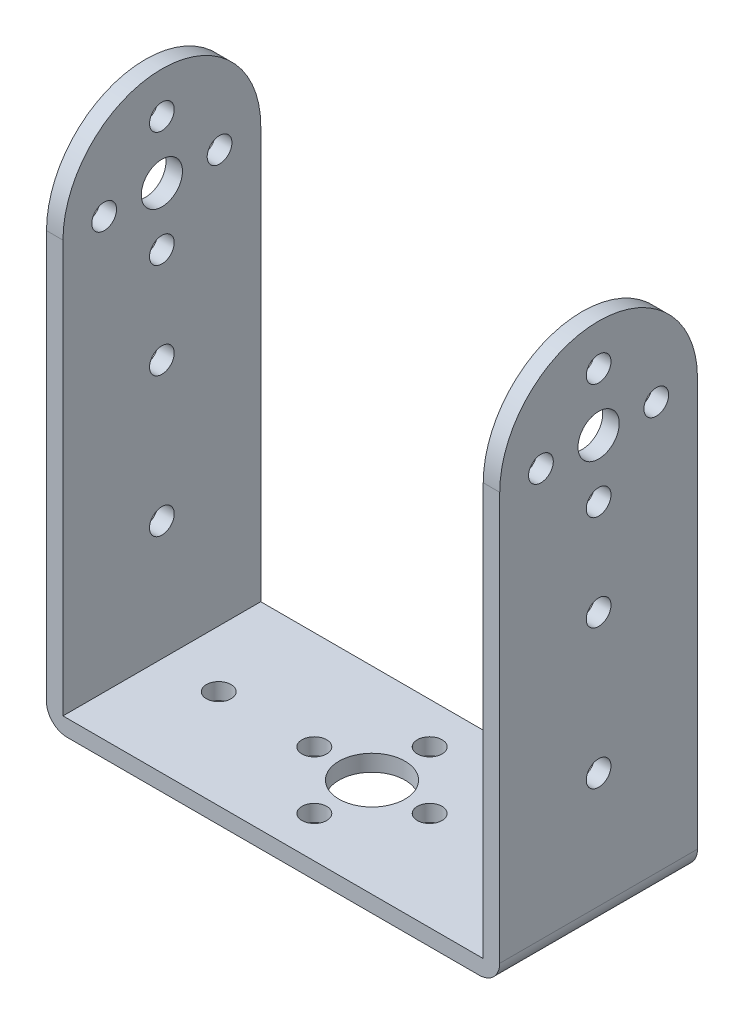
ISO-10303-21;
HEADER;
FILE_DESCRIPTION(('STEP AP214'),'2;1');
FILE_NAME('part.step','',(''),(''),'','','');
FILE_SCHEMA(('AUTOMOTIVE_DESIGN { 1 0 10303 214 1 1 1 1 }'));
ENDSEC;
DATA;
#1=APPLICATION_CONTEXT('core data for automotive mechanical design processes');
#2=APPLICATION_PROTOCOL_DEFINITION('international standard','automotive_design',2000,#1);
#3=PRODUCT_CONTEXT('',#1,'mechanical');
#4=PRODUCT('Part','Part','',(#3));
#5=PRODUCT_RELATED_PRODUCT_CATEGORY('part','',(#4));
#6=PRODUCT_DEFINITION_FORMATION('','',#4);
#7=PRODUCT_DEFINITION_CONTEXT('part definition',#1,'design');
#8=PRODUCT_DEFINITION('design','',#6,#7);
#9=PRODUCT_DEFINITION_SHAPE('','',#8);
#10=(LENGTH_UNIT() NAMED_UNIT(*) SI_UNIT(.MILLI.,.METRE.));
#11=(NAMED_UNIT(*) PLANE_ANGLE_UNIT() SI_UNIT($,.RADIAN.));
#12=(NAMED_UNIT(*) SI_UNIT($,.STERADIAN.) SOLID_ANGLE_UNIT());
#13=UNCERTAINTY_MEASURE_WITH_UNIT(LENGTH_MEASURE(1.E-05),#10,'distance_accuracy_value','');
#14=(GEOMETRIC_REPRESENTATION_CONTEXT(3) GLOBAL_UNCERTAINTY_ASSIGNED_CONTEXT((#13)) GLOBAL_UNIT_ASSIGNED_CONTEXT((#10,
#11,#12)) REPRESENTATION_CONTEXT('',''));
#15=CARTESIAN_POINT('',(0.,0.,0.));
#16=DIRECTION('',(0.,0.,1.));
#17=DIRECTION('',(1.,0.,0.));
#18=AXIS2_PLACEMENT_3D('',#15,#16,#17);
#19=CARTESIAN_POINT('',(0.,2.,0.));
#20=DIRECTION('',(0.,-1.,0.));
#21=DIRECTION('',(0.,0.,-1.));
#22=AXIS2_PLACEMENT_3D('',#19,#20,#21);
#23=PLANE('',#22);
#24=CARTESIAN_POINT('',(0.,2.,0.));
#25=DIRECTION('',(0.,1.,0.));
#26=DIRECTION('',(0.,0.,1.));
#27=AXIS2_PLACEMENT_3D('',#24,#25,#26);
#28=CIRCLE('',#27,4.);
#29=CARTESIAN_POINT('',(0.,2.,4.));
#30=VERTEX_POINT('',#29);
#31=EDGE_CURVE('E294',#30,#30,#28,.T.);
#32=ORIENTED_EDGE('',*,*,#31,.F.);
#33=EDGE_LOOP('',(#32));
#34=FACE_BOUND('',#33,.T.);
#35=CARTESIAN_POINT('',(0.,2.,-7.));
#36=DIRECTION('',(0.,1.,0.));
#37=DIRECTION('',(0.,0.,1.));
#38=AXIS2_PLACEMENT_3D('',#35,#36,#37);
#39=CIRCLE('',#38,1.5);
#40=CARTESIAN_POINT('',(0.,2.,-5.5));
#41=VERTEX_POINT('',#40);
#42=EDGE_CURVE('E286',#41,#41,#39,.T.);
#43=ORIENTED_EDGE('',*,*,#42,.F.);
#44=EDGE_LOOP('',(#43));
#45=FACE_BOUND('',#44,.T.);
#46=CARTESIAN_POINT('',(-18.6,2.,0.));
#47=DIRECTION('',(0.,1.,0.));
#48=DIRECTION('',(0.,0.,1.));
#49=AXIS2_PLACEMENT_3D('',#46,#47,#48);
#50=CIRCLE('',#49,1.5);
#51=CARTESIAN_POINT('',(-18.6,2.,1.5));
#52=VERTEX_POINT('',#51);
#53=EDGE_CURVE('E278',#52,#52,#50,.T.);
#54=ORIENTED_EDGE('',*,*,#53,.F.);
#55=EDGE_LOOP('',(#54));
#56=FACE_BOUND('',#55,.T.);
#57=CARTESIAN_POINT('',(7.00000000000079,2.,-7.94228966325903E-13));
#58=DIRECTION('',(0.,1.,0.));
#59=DIRECTION('',(0.,0.,1.));
#60=AXIS2_PLACEMENT_3D('',#57,#58,#59);
#61=CIRCLE('',#60,1.50000000000054);
#62=CARTESIAN_POINT('',(7.00000000000079,2.,1.49999999999975));
#63=VERTEX_POINT('',#62);
#64=EDGE_CURVE('E270',#63,#63,#61,.T.);
#65=ORIENTED_EDGE('',*,*,#64,.F.);
#66=EDGE_LOOP('',(#65));
#67=FACE_BOUND('',#66,.T.);
#68=CARTESIAN_POINT('',(1.58845793265181E-12,2.,7.));
#69=DIRECTION('',(0.,1.,0.));
#70=DIRECTION('',(0.,0.,1.));
#71=AXIS2_PLACEMENT_3D('',#68,#69,#70);
#72=CIRCLE('',#71,1.50000000000156);
#73=CARTESIAN_POINT('',(1.58845793265181E-12,2.,8.50000000000156));
#74=VERTEX_POINT('',#73);
#75=EDGE_CURVE('E262',#74,#74,#72,.T.);
#76=ORIENTED_EDGE('',*,*,#75,.F.);
#77=EDGE_LOOP('',(#76));
#78=FACE_BOUND('',#77,.T.);
#79=CARTESIAN_POINT('',(-6.99999999999921,2.,7.95086219085306E-13));
#80=DIRECTION('',(0.,1.,0.));
#81=DIRECTION('',(0.,0.,1.));
#82=AXIS2_PLACEMENT_3D('',#79,#80,#81);
#83=CIRCLE('',#82,1.50000000000106);
#84=CARTESIAN_POINT('',(-6.99999999999921,2.,1.50000000000185));
#85=VERTEX_POINT('',#84);
#86=EDGE_CURVE('E254',#85,#85,#83,.T.);
#87=ORIENTED_EDGE('',*,*,#86,.F.);
#88=EDGE_LOOP('',(#87));
#89=FACE_BOUND('',#88,.T.);
#90=CARTESIAN_POINT('',(18.6,2.,0.));
#91=DIRECTION('',(0.,1.,0.));
#92=DIRECTION('',(0.,0.,-1.));
#93=AXIS2_PLACEMENT_3D('',#90,#91,#92);
#94=CIRCLE('',#93,1.5);
#95=CARTESIAN_POINT('',(18.6,2.,-1.5));
#96=VERTEX_POINT('',#95);
#97=EDGE_CURVE('E246',#96,#96,#94,.T.);
#98=ORIENTED_EDGE('',*,*,#97,.F.);
#99=EDGE_LOOP('',(#98));
#100=FACE_BOUND('',#99,.T.);
#101=DIRECTION('',(0.,0.,1.));
#102=VECTOR('',#101,1.);
#103=CARTESIAN_POINT('',(25.5,2.,0.));
#104=LINE('',#103,#102);
#105=CARTESIAN_POINT('',(25.5,2.00000000000002,-12.));
#106=VERTEX_POINT('',#105);
#107=CARTESIAN_POINT('',(25.5,2.,12.));
#108=VERTEX_POINT('',#107);
#109=EDGE_CURVE('E159',#106,#108,#104,.T.);
#110=ORIENTED_EDGE('',*,*,#109,.F.);
#111=DIRECTION('',(-1.,0.,0.));
#112=VECTOR('',#111,1.);
#113=CARTESIAN_POINT('',(-27.5,2.,-12.));
#114=LINE('',#113,#112);
#115=CARTESIAN_POINT('',(-25.5,2.,-12.));
#116=VERTEX_POINT('',#115);
#117=EDGE_CURVE('E145',#106,#116,#114,.T.);
#118=ORIENTED_EDGE('',*,*,#117,.T.);
#119=DIRECTION('',(0.,0.,-1.));
#120=VECTOR('',#119,1.);
#121=CARTESIAN_POINT('',(-25.5,2.,0.));
#122=LINE('',#121,#120);
#123=CARTESIAN_POINT('',(-25.5,2.,12.));
#124=VERTEX_POINT('',#123);
#125=EDGE_CURVE('E238',#124,#116,#122,.T.);
#126=ORIENTED_EDGE('',*,*,#125,.F.);
#127=DIRECTION('',(1.,0.,0.));
#128=VECTOR('',#127,1.);
#129=CARTESIAN_POINT('',(-27.5,2.,12.));
#130=LINE('',#129,#128);
#131=EDGE_CURVE('E304',#124,#108,#130,.T.);
#132=ORIENTED_EDGE('',*,*,#131,.T.);
#133=EDGE_LOOP('',(#110,#118,#126,#132));
#134=FACE_BOUND('',#133,.T.);
#135=ADVANCED_FACE('F39',(#34,#45,#56,#67,#78,#89,#100,#134),#23,.F.);
#136=CARTESIAN_POINT('',(0.,0.,0.));
#137=DIRECTION('',(0.,-1.,0.));
#138=DIRECTION('',(0.,0.,-1.));
#139=AXIS2_PLACEMENT_3D('',#136,#137,#138);
#140=PLANE('',#139);
#141=DIRECTION('',(-1.,0.,0.));
#142=VECTOR('',#141,1.);
#143=CARTESIAN_POINT('',(-27.5,0.,-12.));
#144=LINE('',#143,#142);
#145=CARTESIAN_POINT('',(25.,0.,-12.));
#146=VERTEX_POINT('',#145);
#147=CARTESIAN_POINT('',(-25.,0.,-12.));
#148=VERTEX_POINT('',#147);
#149=EDGE_CURVE('E298',#146,#148,#144,.T.);
#150=ORIENTED_EDGE('',*,*,#149,.F.);
#151=DIRECTION('',(0.,0.,-1.));
#152=VECTOR('',#151,1.);
#153=CARTESIAN_POINT('',(25.,0.,12.));
#154=LINE('',#153,#152);
#155=CARTESIAN_POINT('',(25.,0.,12.));
#156=VERTEX_POINT('',#155);
#157=EDGE_CURVE('E62',#146,#156,#154,.F.);
#158=ORIENTED_EDGE('',*,*,#157,.T.);
#159=DIRECTION('',(1.,0.,0.));
#160=VECTOR('',#159,1.);
#161=CARTESIAN_POINT('',(-27.5,0.,12.));
#162=LINE('',#161,#160);
#163=CARTESIAN_POINT('',(-25.,0.,12.));
#164=VERTEX_POINT('',#163);
#165=EDGE_CURVE('E305',#164,#156,#162,.T.);
#166=ORIENTED_EDGE('',*,*,#165,.F.);
#167=DIRECTION('',(0.,0.,1.));
#168=VECTOR('',#167,1.);
#169=CARTESIAN_POINT('',(-25.,0.,-12.));
#170=LINE('',#169,#168);
#171=EDGE_CURVE('E338',#164,#148,#170,.F.);
#172=ORIENTED_EDGE('',*,*,#171,.T.);
#173=EDGE_LOOP('',(#150,#158,#166,#172));
#174=FACE_BOUND('',#173,.T.);
#175=CARTESIAN_POINT('',(-6.99999999999921,0.,7.95086219085306E-13));
#176=DIRECTION('',(0.,1.,0.));
#177=DIRECTION('',(0.,0.,1.));
#178=AXIS2_PLACEMENT_3D('',#175,#176,#177);
#179=CIRCLE('',#178,1.50000000000106);
#180=CARTESIAN_POINT('',(-6.99999999999921,0.,1.50000000000185));
#181=VERTEX_POINT('',#180);
#182=EDGE_CURVE('E250',#181,#181,#179,.T.);
#183=ORIENTED_EDGE('',*,*,#182,.T.);
#184=EDGE_LOOP('',(#183));
#185=FACE_BOUND('',#184,.T.);
#186=CARTESIAN_POINT('',(7.00000000000079,0.,-7.94228966325903E-13));
#187=DIRECTION('',(0.,1.,0.));
#188=DIRECTION('',(0.,0.,1.));
#189=AXIS2_PLACEMENT_3D('',#186,#187,#188);
#190=CIRCLE('',#189,1.50000000000054);
#191=CARTESIAN_POINT('',(7.00000000000079,0.,1.49999999999975));
#192=VERTEX_POINT('',#191);
#193=EDGE_CURVE('E266',#192,#192,#190,.T.);
#194=ORIENTED_EDGE('',*,*,#193,.T.);
#195=EDGE_LOOP('',(#194));
#196=FACE_BOUND('',#195,.T.);
#197=CARTESIAN_POINT('',(0.,0.,-7.));
#198=DIRECTION('',(0.,1.,0.));
#199=DIRECTION('',(0.,0.,1.));
#200=AXIS2_PLACEMENT_3D('',#197,#198,#199);
#201=CIRCLE('',#200,1.5);
#202=CARTESIAN_POINT('',(0.,0.,-5.5));
#203=VERTEX_POINT('',#202);
#204=EDGE_CURVE('E282',#203,#203,#201,.T.);
#205=ORIENTED_EDGE('',*,*,#204,.T.);
#206=EDGE_LOOP('',(#205));
#207=FACE_BOUND('',#206,.T.);
#208=CARTESIAN_POINT('',(0.,0.,0.));
#209=DIRECTION('',(0.,1.,0.));
#210=DIRECTION('',(0.,0.,1.));
#211=AXIS2_PLACEMENT_3D('',#208,#209,#210);
#212=CIRCLE('',#211,4.);
#213=CARTESIAN_POINT('',(0.,0.,4.));
#214=VERTEX_POINT('',#213);
#215=EDGE_CURVE('E290',#214,#214,#212,.T.);
#216=ORIENTED_EDGE('',*,*,#215,.T.);
#217=EDGE_LOOP('',(#216));
#218=FACE_BOUND('',#217,.T.);
#219=CARTESIAN_POINT('',(-18.6,0.,0.));
#220=DIRECTION('',(0.,1.,0.));
#221=DIRECTION('',(0.,0.,1.));
#222=AXIS2_PLACEMENT_3D('',#219,#220,#221);
#223=CIRCLE('',#222,1.5);
#224=CARTESIAN_POINT('',(-18.6,0.,1.5));
#225=VERTEX_POINT('',#224);
#226=EDGE_CURVE('E274',#225,#225,#223,.T.);
#227=ORIENTED_EDGE('',*,*,#226,.T.);
#228=EDGE_LOOP('',(#227));
#229=FACE_BOUND('',#228,.T.);
#230=CARTESIAN_POINT('',(1.58845793265181E-12,0.,7.));
#231=DIRECTION('',(0.,1.,0.));
#232=DIRECTION('',(0.,0.,1.));
#233=AXIS2_PLACEMENT_3D('',#230,#231,#232);
#234=CIRCLE('',#233,1.50000000000156);
#235=CARTESIAN_POINT('',(1.58845793265181E-12,0.,8.50000000000156));
#236=VERTEX_POINT('',#235);
#237=EDGE_CURVE('E258',#236,#236,#234,.T.);
#238=ORIENTED_EDGE('',*,*,#237,.T.);
#239=EDGE_LOOP('',(#238));
#240=FACE_BOUND('',#239,.T.);
#241=CARTESIAN_POINT('',(18.6,0.,0.));
#242=DIRECTION('',(0.,1.,0.));
#243=DIRECTION('',(0.,0.,-1.));
#244=AXIS2_PLACEMENT_3D('',#241,#242,#243);
#245=CIRCLE('',#244,1.5);
#246=CARTESIAN_POINT('',(18.6,0.,-1.5));
#247=VERTEX_POINT('',#246);
#248=EDGE_CURVE('E245',#247,#247,#245,.T.);
#249=ORIENTED_EDGE('',*,*,#248,.T.);
#250=EDGE_LOOP('',(#249));
#251=FACE_BOUND('',#250,.T.);
#252=ADVANCED_FACE('F355',(#174,#185,#196,#207,#218,#229,#240,#251),#140,.T.);
#253=CARTESIAN_POINT('',(27.5,2.,12.));
#254=DIRECTION('',(-1.,0.,0.));
#255=DIRECTION('',(0.,0.,1.));
#256=AXIS2_PLACEMENT_3D('',#253,#254,#255);
#257=PLANE('',#256);
#258=DIRECTION('',(0.,-1.,0.));
#259=VECTOR('',#258,1.);
#260=CARTESIAN_POINT('',(27.5,2.,12.));
#261=LINE('',#260,#259);
#262=CARTESIAN_POINT('',(27.5,52.,12.));
#263=VERTEX_POINT('',#262);
#264=CARTESIAN_POINT('',(27.5,2.5,12.));
#265=VERTEX_POINT('',#264);
#266=EDGE_CURVE('E308',#263,#265,#261,.T.);
#267=ORIENTED_EDGE('',*,*,#266,.T.);
#268=DIRECTION('',(0.,0.,-1.));
#269=VECTOR('',#268,1.);
#270=CARTESIAN_POINT('',(27.5,2.5,-12.));
#271=LINE('',#270,#269);
#272=CARTESIAN_POINT('',(27.5,2.5,-12.));
#273=VERTEX_POINT('',#272);
#274=EDGE_CURVE('E328',#265,#273,#271,.T.);
#275=ORIENTED_EDGE('',*,*,#274,.T.);
#276=DIRECTION('',(0.,-1.,0.));
#277=VECTOR('',#276,1.);
#278=CARTESIAN_POINT('',(27.5,2.,-12.));
#279=LINE('',#278,#277);
#280=CARTESIAN_POINT('',(27.5,52.,-12.));
#281=VERTEX_POINT('',#280);
#282=EDGE_CURVE('E325',#281,#273,#279,.T.);
#283=ORIENTED_EDGE('',*,*,#282,.F.);
#284=CARTESIAN_POINT('',(27.5,52.,0.));
#285=DIRECTION('',(-1.,0.,0.));
#286=DIRECTION('',(0.,0.,1.));
#287=AXIS2_PLACEMENT_3D('',#284,#285,#286);
#288=CIRCLE('',#287,12.);
#289=EDGE_CURVE('E137',#263,#281,#288,.T.);
#290=ORIENTED_EDGE('',*,*,#289,.F.);
#291=EDGE_LOOP('',(#267,#275,#283,#290));
#292=FACE_BOUND('',#291,.T.);
#293=CARTESIAN_POINT('',(27.5,33.4,0.));
#294=DIRECTION('',(-1.,0.,0.));
#295=DIRECTION('',(0.,0.,1.));
#296=AXIS2_PLACEMENT_3D('',#293,#294,#295);
#297=CIRCLE('',#296,1.5);
#298=CARTESIAN_POINT('',(27.5,33.4,1.5));
#299=VERTEX_POINT('',#298);
#300=EDGE_CURVE('E791',#299,#299,#297,.T.);
#301=ORIENTED_EDGE('',*,*,#300,.T.);
#302=EDGE_LOOP('',(#301));
#303=FACE_BOUND('',#302,.T.);
#304=CARTESIAN_POINT('',(27.5,45.,1.43162660300873E-13));
#305=DIRECTION('',(-1.,0.,0.));
#306=DIRECTION('',(0.,0.,1.));
#307=AXIS2_PLACEMENT_3D('',#304,#305,#306);
#308=CIRCLE('',#307,1.5);
#309=CARTESIAN_POINT('',(27.5,45.,1.50000000000014));
#310=VERTEX_POINT('',#309);
#311=EDGE_CURVE('E801',#310,#310,#308,.T.);
#312=ORIENTED_EDGE('',*,*,#311,.T.);
#313=EDGE_LOOP('',(#312));
#314=FACE_BOUND('',#313,.T.);
#315=CARTESIAN_POINT('',(27.5,59.,0.));
#316=DIRECTION('',(-1.,0.,0.));
#317=DIRECTION('',(0.,0.,1.));
#318=AXIS2_PLACEMENT_3D('',#315,#316,#317);
#319=CIRCLE('',#318,1.5);
#320=CARTESIAN_POINT('',(27.5,59.,1.5));
#321=VERTEX_POINT('',#320);
#322=EDGE_CURVE('E811',#321,#321,#319,.T.);
#323=ORIENTED_EDGE('',*,*,#322,.T.);
#324=EDGE_LOOP('',(#323));
#325=FACE_BOUND('',#324,.T.);
#326=CARTESIAN_POINT('',(27.5,16.5,0.));
#327=DIRECTION('',(-1.,0.,0.));
#328=DIRECTION('',(0.,0.,1.));
#329=AXIS2_PLACEMENT_3D('',#326,#327,#328);
#330=CIRCLE('',#329,1.5);
#331=CARTESIAN_POINT('',(27.5,16.5,1.5));
#332=VERTEX_POINT('',#331);
#333=EDGE_CURVE('E153',#332,#332,#330,.T.);
#334=ORIENTED_EDGE('',*,*,#333,.T.);
#335=EDGE_LOOP('',(#334));
#336=FACE_BOUND('',#335,.T.);
#337=CARTESIAN_POINT('',(27.5,52.,0.));
#338=DIRECTION('',(-1.,0.,0.));
#339=DIRECTION('',(0.,0.,1.));
#340=AXIS2_PLACEMENT_3D('',#337,#338,#339);
#341=CIRCLE('',#340,2.5);
#342=CARTESIAN_POINT('',(27.5,52.,2.5));
#343=VERTEX_POINT('',#342);
#344=EDGE_CURVE('E817',#343,#343,#341,.T.);
#345=ORIENTED_EDGE('',*,*,#344,.T.);
#346=EDGE_LOOP('',(#345));
#347=FACE_BOUND('',#346,.T.);
#348=CARTESIAN_POINT('',(27.5,52.0000000000001,7.0000000000001));
#349=DIRECTION('',(-1.,0.,0.));
#350=DIRECTION('',(0.,0.,1.));
#351=AXIS2_PLACEMENT_3D('',#348,#349,#350);
#352=CIRCLE('',#351,1.5);
#353=CARTESIAN_POINT('',(27.5,52.0000000000001,8.5000000000001));
#354=VERTEX_POINT('',#353);
#355=EDGE_CURVE('E805',#354,#354,#352,.T.);
#356=ORIENTED_EDGE('',*,*,#355,.T.);
#357=EDGE_LOOP('',(#356));
#358=FACE_BOUND('',#357,.T.);
#359=CARTESIAN_POINT('',(27.5,52.,-6.9999999999999));
#360=DIRECTION('',(-1.,0.,0.));
#361=DIRECTION('',(0.,0.,1.));
#362=AXIS2_PLACEMENT_3D('',#359,#360,#361);
#363=CIRCLE('',#362,1.50000000000001);
#364=CARTESIAN_POINT('',(27.5,52.,-5.4999999999999));
#365=VERTEX_POINT('',#364);
#366=EDGE_CURVE('E790',#365,#365,#363,.T.);
#367=ORIENTED_EDGE('',*,*,#366,.T.);
#368=EDGE_LOOP('',(#367));
#369=FACE_BOUND('',#368,.T.);
#370=ADVANCED_FACE('F351',(#292,#303,#314,#325,#336,#347,#358,#369),#257,.F.);
#371=CARTESIAN_POINT('',(-27.5,2.,-12.));
#372=DIRECTION('',(0.,0.,1.));
#373=DIRECTION('',(1.,0.,0.));
#374=AXIS2_PLACEMENT_3D('',#371,#372,#373);
#375=PLANE('',#374);
#376=ORIENTED_EDGE('',*,*,#282,.T.);
#377=CARTESIAN_POINT('',(25.,2.5,-12.));
#378=DIRECTION('',(0.,0.,1.));
#379=DIRECTION('',(1.,0.,0.));
#380=AXIS2_PLACEMENT_3D('',#377,#378,#379);
#381=CIRCLE('',#380,2.5);
#382=EDGE_CURVE('E335',#273,#146,#381,.F.);
#383=ORIENTED_EDGE('',*,*,#382,.T.);
#384=ORIENTED_EDGE('',*,*,#149,.T.);
#385=CARTESIAN_POINT('',(-25.,2.5,-12.));
#386=DIRECTION('',(0.,0.,1.));
#387=DIRECTION('',(1.,0.,0.));
#388=AXIS2_PLACEMENT_3D('',#385,#386,#387);
#389=CIRCLE('',#388,2.5);
#390=CARTESIAN_POINT('',(-27.5,2.5,-12.));
#391=VERTEX_POINT('',#390);
#392=EDGE_CURVE('E332',#148,#391,#389,.F.);
#393=ORIENTED_EDGE('',*,*,#392,.T.);
#394=DIRECTION('',(0.,-1.,0.));
#395=VECTOR('',#394,1.);
#396=CARTESIAN_POINT('',(-27.5,2.,-12.));
#397=LINE('',#396,#395);
#398=CARTESIAN_POINT('',(-27.5,52.,-12.));
#399=VERTEX_POINT('',#398);
#400=EDGE_CURVE('E321',#399,#391,#397,.T.);
#401=ORIENTED_EDGE('',*,*,#400,.F.);
#402=DIRECTION('',(-1.,0.,0.));
#403=VECTOR('',#402,1.);
#404=CARTESIAN_POINT('',(-25.5,52.,-12.));
#405=LINE('',#404,#403);
#406=CARTESIAN_POINT('',(-25.5,52.,-12.));
#407=VERTEX_POINT('',#406);
#408=EDGE_CURVE('E234',#407,#399,#405,.T.);
#409=ORIENTED_EDGE('',*,*,#408,.F.);
#410=DIRECTION('',(0.,-1.,0.));
#411=VECTOR('',#410,1.);
#412=CARTESIAN_POINT('',(-25.5,52.,-12.));
#413=LINE('',#412,#411);
#414=EDGE_CURVE('E227',#407,#116,#413,.T.);
#415=ORIENTED_EDGE('',*,*,#414,.T.);
#416=ORIENTED_EDGE('',*,*,#117,.F.);
#417=DIRECTION('',(0.,-1.,0.));
#418=VECTOR('',#417,1.);
#419=CARTESIAN_POINT('',(25.5,52.,-12.));
#420=LINE('',#419,#418);
#421=CARTESIAN_POINT('',(25.5,52.,-12.));
#422=VERTEX_POINT('',#421);
#423=EDGE_CURVE('E124',#422,#106,#420,.T.);
#424=ORIENTED_EDGE('',*,*,#423,.F.);
#425=DIRECTION('',(1.,0.,0.));
#426=VECTOR('',#425,1.);
#427=CARTESIAN_POINT('',(25.5,52.,-12.));
#428=LINE('',#427,#426);
#429=EDGE_CURVE('E134',#422,#281,#428,.T.);
#430=ORIENTED_EDGE('',*,*,#429,.T.);
#431=EDGE_LOOP('',(#376,#383,#384,#393,#401,#409,#415,#416,#424,#430));
#432=FACE_BOUND('',#431,.T.);
#433=ADVANCED_FACE('F143',(#432),#375,.F.);
#434=CARTESIAN_POINT('',(-27.5,2.,12.));
#435=DIRECTION('',(1.,0.,0.));
#436=DIRECTION('',(0.,0.,-1.));
#437=AXIS2_PLACEMENT_3D('',#434,#435,#436);
#438=PLANE('',#437);
#439=ORIENTED_EDGE('',*,*,#400,.T.);
#440=DIRECTION('',(0.,0.,1.));
#441=VECTOR('',#440,1.);
#442=CARTESIAN_POINT('',(-27.5,2.5,12.));
#443=LINE('',#442,#441);
#444=CARTESIAN_POINT('',(-27.5,2.5,12.));
#445=VERTEX_POINT('',#444);
#446=EDGE_CURVE('E11',#391,#445,#443,.T.);
#447=ORIENTED_EDGE('',*,*,#446,.T.);
#448=DIRECTION('',(0.,-1.,0.));
#449=VECTOR('',#448,1.);
#450=CARTESIAN_POINT('',(-27.5,2.,12.));
#451=LINE('',#450,#449);
#452=CARTESIAN_POINT('',(-27.5,52.,12.));
#453=VERTEX_POINT('',#452);
#454=EDGE_CURVE('E317',#453,#445,#451,.T.);
#455=ORIENTED_EDGE('',*,*,#454,.F.);
#456=CARTESIAN_POINT('',(-27.5,52.,0.));
#457=DIRECTION('',(-1.,0.,0.));
#458=DIRECTION('',(0.,0.,1.));
#459=AXIS2_PLACEMENT_3D('',#456,#457,#458);
#460=CIRCLE('',#459,12.);
#461=EDGE_CURVE('E216',#453,#399,#460,.T.);
#462=ORIENTED_EDGE('',*,*,#461,.T.);
#463=EDGE_LOOP('',(#439,#447,#455,#462));
#464=FACE_BOUND('',#463,.T.);
#465=CARTESIAN_POINT('',(-27.5,16.5,0.));
#466=DIRECTION('',(-1.,0.,0.));
#467=DIRECTION('',(0.,0.,1.));
#468=AXIS2_PLACEMENT_3D('',#465,#466,#467);
#469=CIRCLE('',#468,1.5);
#470=CARTESIAN_POINT('',(-27.5,16.5,1.5));
#471=VERTEX_POINT('',#470);
#472=EDGE_CURVE('E208',#471,#471,#469,.T.);
#473=ORIENTED_EDGE('',*,*,#472,.F.);
#474=EDGE_LOOP('',(#473));
#475=FACE_BOUND('',#474,.T.);
#476=CARTESIAN_POINT('',(-27.5,52.,0.));
#477=DIRECTION('',(-1.,0.,0.));
#478=DIRECTION('',(0.,0.,1.));
#479=AXIS2_PLACEMENT_3D('',#476,#477,#478);
#480=CIRCLE('',#479,2.5);
#481=CARTESIAN_POINT('',(-27.5,52.,2.5));
#482=VERTEX_POINT('',#481);
#483=EDGE_CURVE('E200',#482,#482,#480,.T.);
#484=ORIENTED_EDGE('',*,*,#483,.F.);
#485=EDGE_LOOP('',(#484));
#486=FACE_BOUND('',#485,.T.);
#487=CARTESIAN_POINT('',(-27.5,59.,0.));
#488=DIRECTION('',(-1.,0.,0.));
#489=DIRECTION('',(0.,0.,1.));
#490=AXIS2_PLACEMENT_3D('',#487,#488,#489);
#491=CIRCLE('',#490,1.5);
#492=CARTESIAN_POINT('',(-27.5,59.,1.5));
#493=VERTEX_POINT('',#492);
#494=EDGE_CURVE('E192',#493,#493,#491,.T.);
#495=ORIENTED_EDGE('',*,*,#494,.F.);
#496=EDGE_LOOP('',(#495));
#497=FACE_BOUND('',#496,.T.);
#498=CARTESIAN_POINT('',(-27.5,52.0000000000001,7.0000000000001));
#499=DIRECTION('',(-1.,0.,0.));
#500=DIRECTION('',(0.,0.,1.));
#501=AXIS2_PLACEMENT_3D('',#498,#499,#500);
#502=CIRCLE('',#501,1.5);
#503=CARTESIAN_POINT('',(-27.5,52.0000000000001,8.5000000000001));
#504=VERTEX_POINT('',#503);
#505=EDGE_CURVE('E184',#504,#504,#502,.T.);
#506=ORIENTED_EDGE('',*,*,#505,.F.);
#507=EDGE_LOOP('',(#506));
#508=FACE_BOUND('',#507,.T.);
#509=CARTESIAN_POINT('',(-27.5,45.,1.43162660300873E-13));
#510=DIRECTION('',(-1.,0.,0.));
#511=DIRECTION('',(0.,0.,1.));
#512=AXIS2_PLACEMENT_3D('',#509,#510,#511);
#513=CIRCLE('',#512,1.5);
#514=CARTESIAN_POINT('',(-27.5,45.,1.50000000000014));
#515=VERTEX_POINT('',#514);
#516=EDGE_CURVE('E176',#515,#515,#513,.T.);
#517=ORIENTED_EDGE('',*,*,#516,.F.);
#518=EDGE_LOOP('',(#517));
#519=FACE_BOUND('',#518,.T.);
#520=CARTESIAN_POINT('',(-27.5,52.,-6.9999999999999));
#521=DIRECTION('',(-1.,0.,0.));
#522=DIRECTION('',(0.,0.,1.));
#523=AXIS2_PLACEMENT_3D('',#520,#521,#522);
#524=CIRCLE('',#523,1.50000000000001);
#525=CARTESIAN_POINT('',(-27.5,52.,-5.4999999999999));
#526=VERTEX_POINT('',#525);
#527=EDGE_CURVE('E168',#526,#526,#524,.T.);
#528=ORIENTED_EDGE('',*,*,#527,.F.);
#529=EDGE_LOOP('',(#528));
#530=FACE_BOUND('',#529,.T.);
#531=CARTESIAN_POINT('',(-27.5,33.4,0.));
#532=DIRECTION('',(-1.,0.,0.));
#533=DIRECTION('',(0.,0.,1.));
#534=AXIS2_PLACEMENT_3D('',#531,#532,#533);
#535=CIRCLE('',#534,1.5);
#536=CARTESIAN_POINT('',(-27.5,33.4,1.5));
#537=VERTEX_POINT('',#536);
#538=EDGE_CURVE('E163',#537,#537,#535,.T.);
#539=ORIENTED_EDGE('',*,*,#538,.F.);
#540=EDGE_LOOP('',(#539));
#541=FACE_BOUND('',#540,.T.);
#542=ADVANCED_FACE('F358',(#464,#475,#486,#497,#508,#519,#530,#541),#438,.F.);
#543=CARTESIAN_POINT('',(-27.5,2.,12.));
#544=DIRECTION('',(0.,0.,-1.));
#545=DIRECTION('',(-1.,0.,0.));
#546=AXIS2_PLACEMENT_3D('',#543,#544,#545);
#547=PLANE('',#546);
#548=ORIENTED_EDGE('',*,*,#165,.T.);
#549=CARTESIAN_POINT('',(25.,2.5,12.));
#550=DIRECTION('',(0.,0.,-1.));
#551=DIRECTION('',(-1.,0.,0.));
#552=AXIS2_PLACEMENT_3D('',#549,#550,#551);
#553=CIRCLE('',#552,2.5);
#554=EDGE_CURVE('E48',#156,#265,#553,.F.);
#555=ORIENTED_EDGE('',*,*,#554,.T.);
#556=ORIENTED_EDGE('',*,*,#266,.F.);
#557=DIRECTION('',(1.,0.,0.));
#558=VECTOR('',#557,1.);
#559=CARTESIAN_POINT('',(25.5,52.,12.));
#560=LINE('',#559,#558);
#561=CARTESIAN_POINT('',(25.5,52.,12.));
#562=VERTEX_POINT('',#561);
#563=EDGE_CURVE('E141',#562,#263,#560,.T.);
#564=ORIENTED_EDGE('',*,*,#563,.F.);
#565=DIRECTION('',(0.,1.,0.));
#566=VECTOR('',#565,1.);
#567=CARTESIAN_POINT('',(25.5,0.,12.));
#568=LINE('',#567,#566);
#569=EDGE_CURVE('E126',#108,#562,#568,.T.);
#570=ORIENTED_EDGE('',*,*,#569,.F.);
#571=ORIENTED_EDGE('',*,*,#131,.F.);
#572=DIRECTION('',(0.,1.,0.));
#573=VECTOR('',#572,1.);
#574=CARTESIAN_POINT('',(-25.5,0.,12.));
#575=LINE('',#574,#573);
#576=CARTESIAN_POINT('',(-25.5,52.,12.));
#577=VERTEX_POINT('',#576);
#578=EDGE_CURVE('E220',#124,#577,#575,.T.);
#579=ORIENTED_EDGE('',*,*,#578,.T.);
#580=DIRECTION('',(-1.,0.,0.));
#581=VECTOR('',#580,1.);
#582=CARTESIAN_POINT('',(-25.5,52.,12.));
#583=LINE('',#582,#581);
#584=EDGE_CURVE('E230',#577,#453,#583,.T.);
#585=ORIENTED_EDGE('',*,*,#584,.T.);
#586=ORIENTED_EDGE('',*,*,#454,.T.);
#587=CARTESIAN_POINT('',(-25.,2.5,12.));
#588=DIRECTION('',(0.,0.,-1.));
#589=DIRECTION('',(-1.,0.,0.));
#590=AXIS2_PLACEMENT_3D('',#587,#588,#589);
#591=CIRCLE('',#590,2.5);
#592=EDGE_CURVE('E55',#445,#164,#591,.F.);
#593=ORIENTED_EDGE('',*,*,#592,.T.);
#594=EDGE_LOOP('',(#548,#555,#556,#564,#570,#571,#579,#585,#586,#593));
#595=FACE_BOUND('',#594,.T.);
#596=ADVANCED_FACE('F347',(#595),#547,.F.);
#597=CARTESIAN_POINT('',(0.,2.,0.));
#598=DIRECTION('',(0.,-1.,0.));
#599=DIRECTION('',(0.,0.,-1.));
#600=AXIS2_PLACEMENT_3D('',#597,#598,#599);
#601=CYLINDRICAL_SURFACE('',#600,4.);
#602=ORIENTED_EDGE('',*,*,#31,.T.);
#603=EDGE_LOOP('',(#602));
#604=FACE_BOUND('',#603,.T.);
#605=ORIENTED_EDGE('',*,*,#215,.F.);
#606=EDGE_LOOP('',(#605));
#607=FACE_BOUND('',#606,.T.);
#608=ADVANCED_FACE('F381',(#604,#607),#601,.F.);
#609=CARTESIAN_POINT('',(0.,2.,-7.));
#610=DIRECTION('',(0.,-1.,0.));
#611=DIRECTION('',(0.,0.,-1.));
#612=AXIS2_PLACEMENT_3D('',#609,#610,#611);
#613=CYLINDRICAL_SURFACE('',#612,1.5);
#614=ORIENTED_EDGE('',*,*,#42,.T.);
#615=EDGE_LOOP('',(#614));
#616=FACE_BOUND('',#615,.T.);
#617=ORIENTED_EDGE('',*,*,#204,.F.);
#618=EDGE_LOOP('',(#617));
#619=FACE_BOUND('',#618,.T.);
#620=ADVANCED_FACE('F484',(#616,#619),#613,.F.);
#621=CARTESIAN_POINT('',(-18.6,2.,0.));
#622=DIRECTION('',(0.,-1.,0.));
#623=DIRECTION('',(0.,0.,-1.));
#624=AXIS2_PLACEMENT_3D('',#621,#622,#623);
#625=CYLINDRICAL_SURFACE('',#624,1.5);
#626=ORIENTED_EDGE('',*,*,#53,.T.);
#627=EDGE_LOOP('',(#626));
#628=FACE_BOUND('',#627,.T.);
#629=ORIENTED_EDGE('',*,*,#226,.F.);
#630=EDGE_LOOP('',(#629));
#631=FACE_BOUND('',#630,.T.);
#632=ADVANCED_FACE('F481',(#628,#631),#625,.F.);
#633=CARTESIAN_POINT('',(7.00000000000079,2.,-7.94228966325903E-13));
#634=DIRECTION('',(0.,-1.,0.));
#635=DIRECTION('',(0.,0.,-1.));
#636=AXIS2_PLACEMENT_3D('',#633,#634,#635);
#637=CYLINDRICAL_SURFACE('',#636,1.50000000000054);
#638=ORIENTED_EDGE('',*,*,#64,.T.);
#639=EDGE_LOOP('',(#638));
#640=FACE_BOUND('',#639,.T.);
#641=ORIENTED_EDGE('',*,*,#193,.F.);
#642=EDGE_LOOP('',(#641));
#643=FACE_BOUND('',#642,.T.);
#644=ADVANCED_FACE('F477',(#640,#643),#637,.F.);
#645=CARTESIAN_POINT('',(1.58845793265181E-12,2.,7.));
#646=DIRECTION('',(0.,-1.,0.));
#647=DIRECTION('',(0.,0.,-1.));
#648=AXIS2_PLACEMENT_3D('',#645,#646,#647);
#649=CYLINDRICAL_SURFACE('',#648,1.50000000000156);
#650=ORIENTED_EDGE('',*,*,#75,.T.);
#651=EDGE_LOOP('',(#650));
#652=FACE_BOUND('',#651,.T.);
#653=ORIENTED_EDGE('',*,*,#237,.F.);
#654=EDGE_LOOP('',(#653));
#655=FACE_BOUND('',#654,.T.);
#656=ADVANCED_FACE('F473',(#652,#655),#649,.F.);
#657=CARTESIAN_POINT('',(-6.99999999999921,2.,7.95086219085306E-13));
#658=DIRECTION('',(0.,-1.,0.));
#659=DIRECTION('',(0.,0.,-1.));
#660=AXIS2_PLACEMENT_3D('',#657,#658,#659);
#661=CYLINDRICAL_SURFACE('',#660,1.50000000000106);
#662=ORIENTED_EDGE('',*,*,#86,.T.);
#663=EDGE_LOOP('',(#662));
#664=FACE_BOUND('',#663,.T.);
#665=ORIENTED_EDGE('',*,*,#182,.F.);
#666=EDGE_LOOP('',(#665));
#667=FACE_BOUND('',#666,.T.);
#668=ADVANCED_FACE('F469',(#664,#667),#661,.F.);
#669=CARTESIAN_POINT('',(18.6,2.,0.));
#670=DIRECTION('',(0.,-1.,0.));
#671=DIRECTION('',(0.,0.,-1.));
#672=AXIS2_PLACEMENT_3D('',#669,#670,#671);
#673=CYLINDRICAL_SURFACE('',#672,1.5);
#674=ORIENTED_EDGE('',*,*,#97,.T.);
#675=EDGE_LOOP('',(#674));
#676=FACE_BOUND('',#675,.T.);
#677=ORIENTED_EDGE('',*,*,#248,.F.);
#678=EDGE_LOOP('',(#677));
#679=FACE_BOUND('',#678,.T.);
#680=ADVANCED_FACE('F463',(#676,#679),#673,.F.);
#681=CARTESIAN_POINT('',(-25.5,52.,0.));
#682=DIRECTION('',(-1.,0.,0.));
#683=DIRECTION('',(0.,0.,1.));
#684=AXIS2_PLACEMENT_3D('',#681,#682,#683);
#685=PLANE('',#684);
#686=CARTESIAN_POINT('',(-25.5,33.4,0.));
#687=DIRECTION('',(-1.,0.,0.));
#688=DIRECTION('',(0.,0.,1.));
#689=AXIS2_PLACEMENT_3D('',#686,#687,#688);
#690=CIRCLE('',#689,1.5);
#691=CARTESIAN_POINT('',(-25.5,33.4,1.5));
#692=VERTEX_POINT('',#691);
#693=EDGE_CURVE('E164',#692,#692,#690,.T.);
#694=ORIENTED_EDGE('',*,*,#693,.T.);
#695=EDGE_LOOP('',(#694));
#696=FACE_BOUND('',#695,.T.);
#697=CARTESIAN_POINT('',(-25.5,52.,-6.9999999999999));
#698=DIRECTION('',(-1.,0.,0.));
#699=DIRECTION('',(0.,0.,1.));
#700=AXIS2_PLACEMENT_3D('',#697,#698,#699);
#701=CIRCLE('',#700,1.50000000000001);
#702=CARTESIAN_POINT('',(-25.5,52.,-5.4999999999999));
#703=VERTEX_POINT('',#702);
#704=EDGE_CURVE('E172',#703,#703,#701,.T.);
#705=ORIENTED_EDGE('',*,*,#704,.T.);
#706=EDGE_LOOP('',(#705));
#707=FACE_BOUND('',#706,.T.);
#708=CARTESIAN_POINT('',(-25.5,45.,1.43162660300873E-13));
#709=DIRECTION('',(-1.,0.,0.));
#710=DIRECTION('',(0.,0.,1.));
#711=AXIS2_PLACEMENT_3D('',#708,#709,#710);
#712=CIRCLE('',#711,1.5);
#713=CARTESIAN_POINT('',(-25.5,45.,1.50000000000014));
#714=VERTEX_POINT('',#713);
#715=EDGE_CURVE('E180',#714,#714,#712,.T.);
#716=ORIENTED_EDGE('',*,*,#715,.T.);
#717=EDGE_LOOP('',(#716));
#718=FACE_BOUND('',#717,.T.);
#719=CARTESIAN_POINT('',(-25.5,52.0000000000001,7.0000000000001));
#720=DIRECTION('',(-1.,0.,0.));
#721=DIRECTION('',(0.,0.,1.));
#722=AXIS2_PLACEMENT_3D('',#719,#720,#721);
#723=CIRCLE('',#722,1.5);
#724=CARTESIAN_POINT('',(-25.5,52.0000000000001,8.5000000000001));
#725=VERTEX_POINT('',#724);
#726=EDGE_CURVE('E188',#725,#725,#723,.T.);
#727=ORIENTED_EDGE('',*,*,#726,.T.);
#728=EDGE_LOOP('',(#727));
#729=FACE_BOUND('',#728,.T.);
#730=CARTESIAN_POINT('',(-25.5,59.,0.));
#731=DIRECTION('',(-1.,0.,0.));
#732=DIRECTION('',(0.,0.,1.));
#733=AXIS2_PLACEMENT_3D('',#730,#731,#732);
#734=CIRCLE('',#733,1.5);
#735=CARTESIAN_POINT('',(-25.5,59.,1.5));
#736=VERTEX_POINT('',#735);
#737=EDGE_CURVE('E196',#736,#736,#734,.T.);
#738=ORIENTED_EDGE('',*,*,#737,.T.);
#739=EDGE_LOOP('',(#738));
#740=FACE_BOUND('',#739,.T.);
#741=CARTESIAN_POINT('',(-25.5,52.,0.));
#742=DIRECTION('',(-1.,0.,0.));
#743=DIRECTION('',(0.,0.,1.));
#744=AXIS2_PLACEMENT_3D('',#741,#742,#743);
#745=CIRCLE('',#744,2.5);
#746=CARTESIAN_POINT('',(-25.5,52.,2.5));
#747=VERTEX_POINT('',#746);
#748=EDGE_CURVE('E204',#747,#747,#745,.T.);
#749=ORIENTED_EDGE('',*,*,#748,.T.);
#750=EDGE_LOOP('',(#749));
#751=FACE_BOUND('',#750,.T.);
#752=CARTESIAN_POINT('',(-25.5,16.5,0.));
#753=DIRECTION('',(-1.,0.,0.));
#754=DIRECTION('',(0.,0.,1.));
#755=AXIS2_PLACEMENT_3D('',#752,#753,#754);
#756=CIRCLE('',#755,1.5);
#757=CARTESIAN_POINT('',(-25.5,16.5,1.5));
#758=VERTEX_POINT('',#757);
#759=EDGE_CURVE('E212',#758,#758,#756,.T.);
#760=ORIENTED_EDGE('',*,*,#759,.T.);
#761=EDGE_LOOP('',(#760));
#762=FACE_BOUND('',#761,.T.);
#763=ORIENTED_EDGE('',*,*,#578,.F.);
#764=ORIENTED_EDGE('',*,*,#125,.T.);
#765=ORIENTED_EDGE('',*,*,#414,.F.);
#766=CARTESIAN_POINT('',(-25.5,52.,0.));
#767=DIRECTION('',(-1.,0.,0.));
#768=DIRECTION('',(0.,0.,1.));
#769=AXIS2_PLACEMENT_3D('',#766,#767,#768);
#770=CIRCLE('',#769,12.);
#771=EDGE_CURVE('E223',#577,#407,#770,.T.);
#772=ORIENTED_EDGE('',*,*,#771,.F.);
#773=EDGE_LOOP('',(#763,#764,#765,#772));
#774=FACE_BOUND('',#773,.T.);
#775=ADVANCED_FACE('F368',(#696,#707,#718,#729,#740,#751,#762,#774),#685,.F.);
#776=CARTESIAN_POINT('',(-25.5,52.,0.));
#777=DIRECTION('',(-1.,0.,0.));
#778=DIRECTION('',(0.,0.,1.));
#779=AXIS2_PLACEMENT_3D('',#776,#777,#778);
#780=CYLINDRICAL_SURFACE('',#779,12.);
#781=ORIENTED_EDGE('',*,*,#461,.F.);
#782=ORIENTED_EDGE('',*,*,#584,.F.);
#783=ORIENTED_EDGE('',*,*,#771,.T.);
#784=ORIENTED_EDGE('',*,*,#408,.T.);
#785=EDGE_LOOP('',(#781,#782,#783,#784));
#786=FACE_BOUND('',#785,.T.);
#787=ADVANCED_FACE('F363',(#786),#780,.T.);
#788=CARTESIAN_POINT('',(-25.5,16.5,0.));
#789=DIRECTION('',(-1.,0.,0.));
#790=DIRECTION('',(0.,0.,1.));
#791=AXIS2_PLACEMENT_3D('',#788,#789,#790);
#792=CYLINDRICAL_SURFACE('',#791,1.5);
#793=ORIENTED_EDGE('',*,*,#759,.F.);
#794=EDGE_LOOP('',(#793));
#795=FACE_BOUND('',#794,.T.);
#796=ORIENTED_EDGE('',*,*,#472,.T.);
#797=EDGE_LOOP('',(#796));
#798=FACE_BOUND('',#797,.T.);
#799=ADVANCED_FACE('F456',(#795,#798),#792,.F.);
#800=CARTESIAN_POINT('',(-25.5,52.,0.));
#801=DIRECTION('',(-1.,0.,0.));
#802=DIRECTION('',(0.,0.,1.));
#803=AXIS2_PLACEMENT_3D('',#800,#801,#802);
#804=CYLINDRICAL_SURFACE('',#803,2.5);
#805=ORIENTED_EDGE('',*,*,#748,.F.);
#806=EDGE_LOOP('',(#805));
#807=FACE_BOUND('',#806,.T.);
#808=ORIENTED_EDGE('',*,*,#483,.T.);
#809=EDGE_LOOP('',(#808));
#810=FACE_BOUND('',#809,.T.);
#811=ADVANCED_FACE('F452',(#807,#810),#804,.F.);
#812=CARTESIAN_POINT('',(-25.5,59.,0.));
#813=DIRECTION('',(-1.,0.,0.));
#814=DIRECTION('',(0.,0.,1.));
#815=AXIS2_PLACEMENT_3D('',#812,#813,#814);
#816=CYLINDRICAL_SURFACE('',#815,1.5);
#817=ORIENTED_EDGE('',*,*,#737,.F.);
#818=EDGE_LOOP('',(#817));
#819=FACE_BOUND('',#818,.T.);
#820=ORIENTED_EDGE('',*,*,#494,.T.);
#821=EDGE_LOOP('',(#820));
#822=FACE_BOUND('',#821,.T.);
#823=ADVANCED_FACE('F448',(#819,#822),#816,.F.);
#824=CARTESIAN_POINT('',(-25.5,52.0000000000001,7.0000000000001));
#825=DIRECTION('',(-1.,0.,0.));
#826=DIRECTION('',(0.,0.,1.));
#827=AXIS2_PLACEMENT_3D('',#824,#825,#826);
#828=CYLINDRICAL_SURFACE('',#827,1.5);
#829=ORIENTED_EDGE('',*,*,#726,.F.);
#830=EDGE_LOOP('',(#829));
#831=FACE_BOUND('',#830,.T.);
#832=ORIENTED_EDGE('',*,*,#505,.T.);
#833=EDGE_LOOP('',(#832));
#834=FACE_BOUND('',#833,.T.);
#835=ADVANCED_FACE('F444',(#831,#834),#828,.F.);
#836=CARTESIAN_POINT('',(-25.5,45.,1.43162660300873E-13));
#837=DIRECTION('',(-1.,0.,0.));
#838=DIRECTION('',(0.,0.,1.));
#839=AXIS2_PLACEMENT_3D('',#836,#837,#838);
#840=CYLINDRICAL_SURFACE('',#839,1.5);
#841=ORIENTED_EDGE('',*,*,#715,.F.);
#842=EDGE_LOOP('',(#841));
#843=FACE_BOUND('',#842,.T.);
#844=ORIENTED_EDGE('',*,*,#516,.T.);
#845=EDGE_LOOP('',(#844));
#846=FACE_BOUND('',#845,.T.);
#847=ADVANCED_FACE('F440',(#843,#846),#840,.F.);
#848=CARTESIAN_POINT('',(-25.5,52.,-6.9999999999999));
#849=DIRECTION('',(-1.,0.,0.));
#850=DIRECTION('',(0.,0.,1.));
#851=AXIS2_PLACEMENT_3D('',#848,#849,#850);
#852=CYLINDRICAL_SURFACE('',#851,1.50000000000001);
#853=ORIENTED_EDGE('',*,*,#704,.F.);
#854=EDGE_LOOP('',(#853));
#855=FACE_BOUND('',#854,.T.);
#856=ORIENTED_EDGE('',*,*,#527,.T.);
#857=EDGE_LOOP('',(#856));
#858=FACE_BOUND('',#857,.T.);
#859=ADVANCED_FACE('F436',(#855,#858),#852,.F.);
#860=CARTESIAN_POINT('',(-25.5,33.4,0.));
#861=DIRECTION('',(-1.,0.,0.));
#862=DIRECTION('',(0.,0.,1.));
#863=AXIS2_PLACEMENT_3D('',#860,#861,#862);
#864=CYLINDRICAL_SURFACE('',#863,1.5);
#865=ORIENTED_EDGE('',*,*,#693,.F.);
#866=EDGE_LOOP('',(#865));
#867=FACE_BOUND('',#866,.T.);
#868=ORIENTED_EDGE('',*,*,#538,.T.);
#869=EDGE_LOOP('',(#868));
#870=FACE_BOUND('',#869,.T.);
#871=ADVANCED_FACE('F430',(#867,#870),#864,.F.);
#872=CARTESIAN_POINT('',(25.5,52.,0.));
#873=DIRECTION('',(1.,0.,0.));
#874=DIRECTION('',(0.,0.,1.));
#875=AXIS2_PLACEMENT_3D('',#872,#873,#874);
#876=PLANE('',#875);
#877=CARTESIAN_POINT('',(25.5,16.5,0.));
#878=DIRECTION('',(-1.,0.,0.));
#879=DIRECTION('',(0.,0.,1.));
#880=AXIS2_PLACEMENT_3D('',#877,#878,#879);
#881=CIRCLE('',#880,1.5);
#882=CARTESIAN_POINT('',(25.5,16.5,1.5));
#883=VERTEX_POINT('',#882);
#884=EDGE_CURVE('E150',#883,#883,#881,.T.);
#885=ORIENTED_EDGE('',*,*,#884,.F.);
#886=EDGE_LOOP('',(#885));
#887=FACE_BOUND('',#886,.T.);
#888=CARTESIAN_POINT('',(25.5,52.,0.));
#889=DIRECTION('',(-1.,0.,0.));
#890=DIRECTION('',(0.,0.,1.));
#891=AXIS2_PLACEMENT_3D('',#888,#889,#890);
#892=CIRCLE('',#891,2.5);
#893=CARTESIAN_POINT('',(25.5,52.,2.5));
#894=VERTEX_POINT('',#893);
#895=EDGE_CURVE('E770',#894,#894,#892,.T.);
#896=ORIENTED_EDGE('',*,*,#895,.F.);
#897=EDGE_LOOP('',(#896));
#898=FACE_BOUND('',#897,.T.);
#899=CARTESIAN_POINT('',(25.5,59.,0.));
#900=DIRECTION('',(-1.,0.,0.));
#901=DIRECTION('',(0.,0.,1.));
#902=AXIS2_PLACEMENT_3D('',#899,#900,#901);
#903=CIRCLE('',#902,1.5);
#904=CARTESIAN_POINT('',(25.5,59.,1.5));
#905=VERTEX_POINT('',#904);
#906=EDGE_CURVE('E774',#905,#905,#903,.T.);
#907=ORIENTED_EDGE('',*,*,#906,.F.);
#908=EDGE_LOOP('',(#907));
#909=FACE_BOUND('',#908,.T.);
#910=CARTESIAN_POINT('',(25.5,52.0000000000001,7.0000000000001));
#911=DIRECTION('',(-1.,0.,0.));
#912=DIRECTION('',(0.,0.,1.));
#913=AXIS2_PLACEMENT_3D('',#910,#911,#912);
#914=CIRCLE('',#913,1.5);
#915=CARTESIAN_POINT('',(25.5,52.0000000000001,8.5000000000001));
#916=VERTEX_POINT('',#915);
#917=EDGE_CURVE('E778',#916,#916,#914,.T.);
#918=ORIENTED_EDGE('',*,*,#917,.F.);
#919=EDGE_LOOP('',(#918));
#920=FACE_BOUND('',#919,.T.);
#921=CARTESIAN_POINT('',(25.5,45.,1.43162660300873E-13));
#922=DIRECTION('',(-1.,0.,0.));
#923=DIRECTION('',(0.,0.,1.));
#924=AXIS2_PLACEMENT_3D('',#921,#922,#923);
#925=CIRCLE('',#924,1.5);
#926=CARTESIAN_POINT('',(25.5,45.,1.50000000000014));
#927=VERTEX_POINT('',#926);
#928=EDGE_CURVE('E782',#927,#927,#925,.T.);
#929=ORIENTED_EDGE('',*,*,#928,.F.);
#930=EDGE_LOOP('',(#929));
#931=FACE_BOUND('',#930,.T.);
#932=CARTESIAN_POINT('',(25.5,52.,-6.9999999999999));
#933=DIRECTION('',(-1.,0.,0.));
#934=DIRECTION('',(0.,0.,1.));
#935=AXIS2_PLACEMENT_3D('',#932,#933,#934);
#936=CIRCLE('',#935,1.50000000000001);
#937=CARTESIAN_POINT('',(25.5,52.,-5.4999999999999));
#938=VERTEX_POINT('',#937);
#939=EDGE_CURVE('E786',#938,#938,#936,.T.);
#940=ORIENTED_EDGE('',*,*,#939,.F.);
#941=EDGE_LOOP('',(#940));
#942=FACE_BOUND('',#941,.T.);
#943=CARTESIAN_POINT('',(25.5,33.4,0.));
#944=DIRECTION('',(-1.,0.,0.));
#945=DIRECTION('',(0.,0.,1.));
#946=AXIS2_PLACEMENT_3D('',#943,#944,#945);
#947=CIRCLE('',#946,1.5);
#948=CARTESIAN_POINT('',(25.5,33.4,1.5));
#949=VERTEX_POINT('',#948);
#950=EDGE_CURVE('E788',#949,#949,#947,.T.);
#951=ORIENTED_EDGE('',*,*,#950,.F.);
#952=EDGE_LOOP('',(#951));
#953=FACE_BOUND('',#952,.T.);
#954=ORIENTED_EDGE('',*,*,#423,.T.);
#955=ORIENTED_EDGE('',*,*,#109,.T.);
#956=ORIENTED_EDGE('',*,*,#569,.T.);
#957=CARTESIAN_POINT('',(25.5,52.,0.));
#958=DIRECTION('',(-1.,0.,0.));
#959=DIRECTION('',(0.,0.,1.));
#960=AXIS2_PLACEMENT_3D('',#957,#958,#959);
#961=CIRCLE('',#960,12.);
#962=EDGE_CURVE('E119',#562,#422,#961,.T.);
#963=ORIENTED_EDGE('',*,*,#962,.T.);
#964=EDGE_LOOP('',(#954,#955,#956,#963));
#965=FACE_BOUND('',#964,.T.);
#966=ADVANCED_FACE('F121',(#887,#898,#909,#920,#931,#942,#953,#965),#876,.F.);
#967=CARTESIAN_POINT('',(25.5,52.,0.));
#968=DIRECTION('',(1.,0.,0.));
#969=DIRECTION('',(0.,0.,-1.));
#970=AXIS2_PLACEMENT_3D('',#967,#968,#969);
#971=CYLINDRICAL_SURFACE('',#970,12.);
#972=ORIENTED_EDGE('',*,*,#289,.T.);
#973=ORIENTED_EDGE('',*,*,#429,.F.);
#974=ORIENTED_EDGE('',*,*,#962,.F.);
#975=ORIENTED_EDGE('',*,*,#563,.T.);
#976=EDGE_LOOP('',(#972,#973,#974,#975));
#977=FACE_BOUND('',#976,.T.);
#978=ADVANCED_FACE('F135',(#977),#971,.T.);
#979=CARTESIAN_POINT('',(25.5,16.5,0.));
#980=DIRECTION('',(1.,0.,0.));
#981=DIRECTION('',(0.,0.,-1.));
#982=AXIS2_PLACEMENT_3D('',#979,#980,#981);
#983=CYLINDRICAL_SURFACE('',#982,1.5);
#984=ORIENTED_EDGE('',*,*,#884,.T.);
#985=EDGE_LOOP('',(#984));
#986=FACE_BOUND('',#985,.T.);
#987=ORIENTED_EDGE('',*,*,#333,.F.);
#988=EDGE_LOOP('',(#987));
#989=FACE_BOUND('',#988,.T.);
#990=ADVANCED_FACE('F423',(#986,#989),#983,.F.);
#991=CARTESIAN_POINT('',(25.5,52.,0.));
#992=DIRECTION('',(1.,0.,0.));
#993=DIRECTION('',(0.,0.,-1.));
#994=AXIS2_PLACEMENT_3D('',#991,#992,#993);
#995=CYLINDRICAL_SURFACE('',#994,2.5);
#996=ORIENTED_EDGE('',*,*,#895,.T.);
#997=EDGE_LOOP('',(#996));
#998=FACE_BOUND('',#997,.T.);
#999=ORIENTED_EDGE('',*,*,#344,.F.);
#1000=EDGE_LOOP('',(#999));
#1001=FACE_BOUND('',#1000,.T.);
#1002=ADVANCED_FACE('F419',(#998,#1001),#995,.F.);
#1003=CARTESIAN_POINT('',(25.5,59.,0.));
#1004=DIRECTION('',(1.,0.,0.));
#1005=DIRECTION('',(0.,0.,-1.));
#1006=AXIS2_PLACEMENT_3D('',#1003,#1004,#1005);
#1007=CYLINDRICAL_SURFACE('',#1006,1.5);
#1008=ORIENTED_EDGE('',*,*,#906,.T.);
#1009=EDGE_LOOP('',(#1008));
#1010=FACE_BOUND('',#1009,.T.);
#1011=ORIENTED_EDGE('',*,*,#322,.F.);
#1012=EDGE_LOOP('',(#1011));
#1013=FACE_BOUND('',#1012,.T.);
#1014=ADVANCED_FACE('F415',(#1010,#1013),#1007,.F.);
#1015=CARTESIAN_POINT('',(25.5,52.0000000000001,7.0000000000001));
#1016=DIRECTION('',(1.,0.,0.));
#1017=DIRECTION('',(0.,0.,-1.));
#1018=AXIS2_PLACEMENT_3D('',#1015,#1016,#1017);
#1019=CYLINDRICAL_SURFACE('',#1018,1.5);
#1020=ORIENTED_EDGE('',*,*,#917,.T.);
#1021=EDGE_LOOP('',(#1020));
#1022=FACE_BOUND('',#1021,.T.);
#1023=ORIENTED_EDGE('',*,*,#355,.F.);
#1024=EDGE_LOOP('',(#1023));
#1025=FACE_BOUND('',#1024,.T.);
#1026=ADVANCED_FACE('F411',(#1022,#1025),#1019,.F.);
#1027=CARTESIAN_POINT('',(25.5,45.,1.43162660300873E-13));
#1028=DIRECTION('',(1.,0.,0.));
#1029=DIRECTION('',(0.,0.,-1.));
#1030=AXIS2_PLACEMENT_3D('',#1027,#1028,#1029);
#1031=CYLINDRICAL_SURFACE('',#1030,1.5);
#1032=ORIENTED_EDGE('',*,*,#928,.T.);
#1033=EDGE_LOOP('',(#1032));
#1034=FACE_BOUND('',#1033,.T.);
#1035=ORIENTED_EDGE('',*,*,#311,.F.);
#1036=EDGE_LOOP('',(#1035));
#1037=FACE_BOUND('',#1036,.T.);
#1038=ADVANCED_FACE('F403',(#1034,#1037),#1031,.F.);
#1039=CARTESIAN_POINT('',(25.5,52.,-6.9999999999999));
#1040=DIRECTION('',(1.,0.,0.));
#1041=DIRECTION('',(0.,0.,-1.));
#1042=AXIS2_PLACEMENT_3D('',#1039,#1040,#1041);
#1043=CYLINDRICAL_SURFACE('',#1042,1.50000000000001);
#1044=ORIENTED_EDGE('',*,*,#939,.T.);
#1045=EDGE_LOOP('',(#1044));
#1046=FACE_BOUND('',#1045,.T.);
#1047=ORIENTED_EDGE('',*,*,#366,.F.);
#1048=EDGE_LOOP('',(#1047));
#1049=FACE_BOUND('',#1048,.T.);
#1050=ADVANCED_FACE('F397',(#1046,#1049),#1043,.F.);
#1051=CARTESIAN_POINT('',(25.5,33.4,0.));
#1052=DIRECTION('',(1.,0.,0.));
#1053=DIRECTION('',(0.,0.,-1.));
#1054=AXIS2_PLACEMENT_3D('',#1051,#1052,#1053);
#1055=CYLINDRICAL_SURFACE('',#1054,1.5);
#1056=ORIENTED_EDGE('',*,*,#950,.T.);
#1057=EDGE_LOOP('',(#1056));
#1058=FACE_BOUND('',#1057,.T.);
#1059=ORIENTED_EDGE('',*,*,#300,.F.);
#1060=EDGE_LOOP('',(#1059));
#1061=FACE_BOUND('',#1060,.T.);
#1062=ADVANCED_FACE('F392',(#1058,#1061),#1055,.F.);
#1063=CARTESIAN_POINT('',(25.,2.5,12.));
#1064=DIRECTION('',(0.,0.,1.));
#1065=DIRECTION('',(1.,0.,0.));
#1066=AXIS2_PLACEMENT_3D('',#1063,#1064,#1065);
#1067=CYLINDRICAL_SURFACE('',#1066,2.5);
#1068=ORIENTED_EDGE('',*,*,#554,.F.);
#1069=ORIENTED_EDGE('',*,*,#157,.F.);
#1070=ORIENTED_EDGE('',*,*,#382,.F.);
#1071=ORIENTED_EDGE('',*,*,#274,.F.);
#1072=EDGE_LOOP('',(#1068,#1069,#1070,#1071));
#1073=FACE_BOUND('',#1072,.T.);
#1074=ADVANCED_FACE('F353',(#1073),#1067,.T.);
#1075=CARTESIAN_POINT('',(-25.,2.5,12.));
#1076=DIRECTION('',(0.,0.,-1.));
#1077=DIRECTION('',(-1.,0.,0.));
#1078=AXIS2_PLACEMENT_3D('',#1075,#1076,#1077);
#1079=CYLINDRICAL_SURFACE('',#1078,2.5);
#1080=ORIENTED_EDGE('',*,*,#392,.F.);
#1081=ORIENTED_EDGE('',*,*,#171,.F.);
#1082=ORIENTED_EDGE('',*,*,#592,.F.);
#1083=ORIENTED_EDGE('',*,*,#446,.F.);
#1084=EDGE_LOOP('',(#1080,#1081,#1082,#1083));
#1085=FACE_BOUND('',#1084,.T.);
#1086=ADVANCED_FACE('F41',(#1085),#1079,.T.);
#1087=CLOSED_SHELL('',(#135,#252,#370,#433,#542,#596,#608,#620,#632,#644,#656,#668,#680,#775,
#787,#799,#811,#823,#835,#847,#859,#871,#966,#978,#990,#1002,#1014,#1026,#1038,#1050,#1062,
#1074,#1086));
#1088=MANIFOLD_SOLID_BREP('B2',#1087);
#1089=ADVANCED_BREP_SHAPE_REPRESENTATION('',(#18,#1088),#14);
#1090=SHAPE_DEFINITION_REPRESENTATION(#9,#1089);
ENDSEC;
END-ISO-10303-21;
